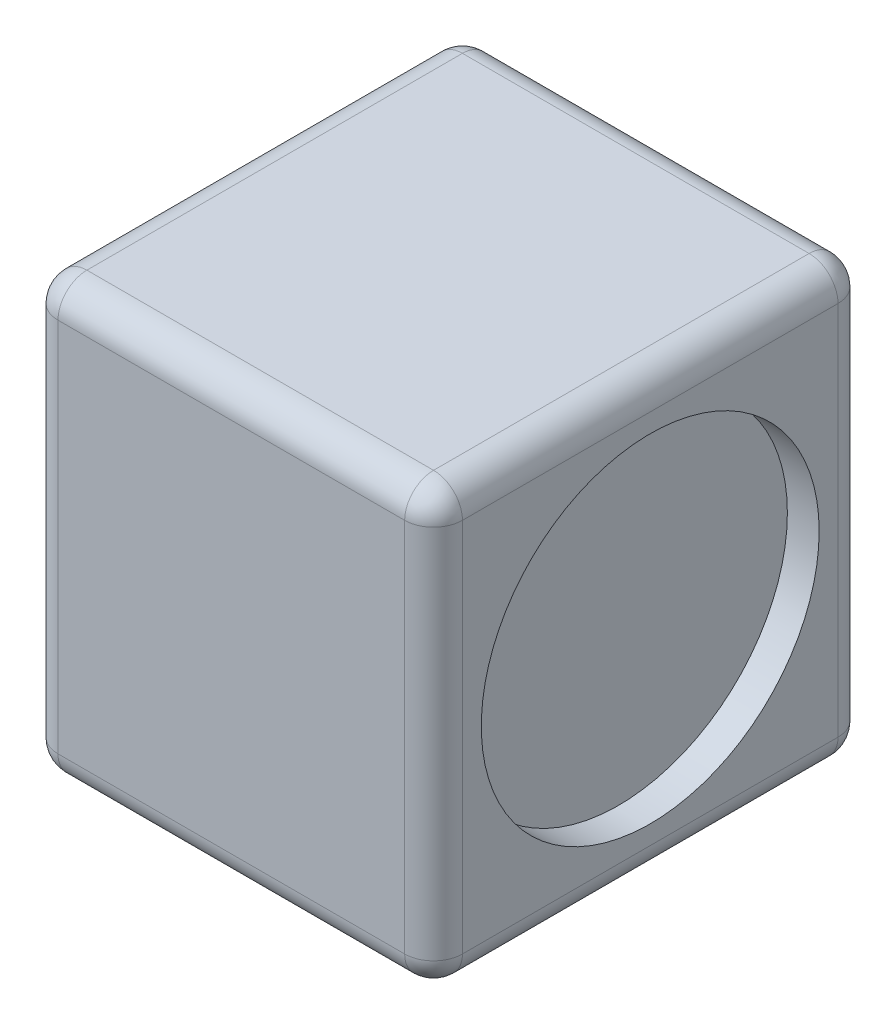
ISO-10303-21;
HEADER;
FILE_DESCRIPTION(('STEP AP214'),'2;1');
FILE_NAME('part.step','',(''),(''),'','','');
FILE_SCHEMA(('AUTOMOTIVE_DESIGN { 1 0 10303 214 1 1 1 1 }'));
ENDSEC;
DATA;
#1=APPLICATION_CONTEXT('core data for automotive mechanical design processes');
#2=APPLICATION_PROTOCOL_DEFINITION('international standard','automotive_design',2000,#1);
#3=PRODUCT_CONTEXT('',#1,'mechanical');
#4=PRODUCT('Part','Part','',(#3));
#5=PRODUCT_RELATED_PRODUCT_CATEGORY('part','',(#4));
#6=PRODUCT_DEFINITION_FORMATION('','',#4);
#7=PRODUCT_DEFINITION_CONTEXT('part definition',#1,'design');
#8=PRODUCT_DEFINITION('design','',#6,#7);
#9=PRODUCT_DEFINITION_SHAPE('','',#8);
#10=(LENGTH_UNIT() NAMED_UNIT(*) SI_UNIT(.MILLI.,.METRE.));
#11=(NAMED_UNIT(*) PLANE_ANGLE_UNIT() SI_UNIT($,.RADIAN.));
#12=(NAMED_UNIT(*) SI_UNIT($,.STERADIAN.) SOLID_ANGLE_UNIT());
#13=UNCERTAINTY_MEASURE_WITH_UNIT(LENGTH_MEASURE(1.E-05),#10,'distance_accuracy_value','');
#14=(GEOMETRIC_REPRESENTATION_CONTEXT(3) GLOBAL_UNCERTAINTY_ASSIGNED_CONTEXT((#13)) GLOBAL_UNIT_ASSIGNED_CONTEXT((#10,
#11,#12)) REPRESENTATION_CONTEXT('',''));
#15=CARTESIAN_POINT('',(0.,0.,0.));
#16=DIRECTION('',(0.,0.,1.));
#17=DIRECTION('',(1.,0.,0.));
#18=AXIS2_PLACEMENT_3D('',#15,#16,#17);
#19=CARTESIAN_POINT('',(0.,0.,0.));
#20=DIRECTION('',(0.,1.,0.));
#21=DIRECTION('',(0.,0.,1.));
#22=AXIS2_PLACEMENT_3D('',#19,#20,#21);
#23=PLANE('',#22);
#24=DIRECTION('',(0.,0.,1.));
#25=VECTOR('',#24,1.);
#26=CARTESIAN_POINT('',(-15.24,0.,0.));
#27=LINE('',#26,#25);
#28=CARTESIAN_POINT('',(-15.24,0.,16.51));
#29=VERTEX_POINT('',#28);
#30=CARTESIAN_POINT('',(-15.24,0.,-16.51));
#31=VERTEX_POINT('',#30);
#32=EDGE_CURVE('E54',#29,#31,#27,.F.);
#33=ORIENTED_EDGE('',*,*,#32,.T.);
#34=DIRECTION('',(-1.,0.,0.));
#35=VECTOR('',#34,1.);
#36=CARTESIAN_POINT('',(0.,0.,-16.51));
#37=LINE('',#36,#35);
#38=CARTESIAN_POINT('',(15.24,0.,-16.51));
#39=VERTEX_POINT('',#38);
#40=EDGE_CURVE('E11',#31,#39,#37,.F.);
#41=ORIENTED_EDGE('',*,*,#40,.T.);
#42=DIRECTION('',(0.,0.,-1.));
#43=VECTOR('',#42,1.);
#44=CARTESIAN_POINT('',(15.24,0.,0.));
#45=LINE('',#44,#43);
#46=CARTESIAN_POINT('',(15.24,0.,16.51));
#47=VERTEX_POINT('',#46);
#48=EDGE_CURVE('E249',#39,#47,#45,.F.);
#49=ORIENTED_EDGE('',*,*,#48,.T.);
#50=DIRECTION('',(1.,0.,0.));
#51=VECTOR('',#50,1.);
#52=CARTESIAN_POINT('',(0.,0.,16.51));
#53=LINE('',#52,#51);
#54=EDGE_CURVE('E251',#47,#29,#53,.F.);
#55=ORIENTED_EDGE('',*,*,#54,.T.);
#56=EDGE_LOOP('',(#33,#41,#49,#55));
#57=FACE_BOUND('',#56,.T.);
#58=DIRECTION('',(1.,0.,0.));
#59=VECTOR('',#58,1.);
#60=CARTESIAN_POINT('',(-8.89,0.,-6.35));
#61=LINE('',#60,#59);
#62=CARTESIAN_POINT('',(-8.89,0.,-6.35));
#63=VERTEX_POINT('',#62);
#64=CARTESIAN_POINT('',(-2.54,0.,-6.35));
#65=VERTEX_POINT('',#64);
#66=EDGE_CURVE('E176',#63,#65,#61,.T.);
#67=ORIENTED_EDGE('',*,*,#66,.F.);
#68=DIRECTION('',(0.,0.,-1.));
#69=VECTOR('',#68,1.);
#70=CARTESIAN_POINT('',(-8.89,0.,6.35));
#71=LINE('',#70,#69);
#72=CARTESIAN_POINT('',(-8.89,0.,6.35));
#73=VERTEX_POINT('',#72);
#74=EDGE_CURVE('E171',#73,#63,#71,.T.);
#75=ORIENTED_EDGE('',*,*,#74,.F.);
#76=DIRECTION('',(1.,0.,0.));
#77=VECTOR('',#76,1.);
#78=CARTESIAN_POINT('',(-8.89,0.,6.35));
#79=LINE('',#78,#77);
#80=CARTESIAN_POINT('',(-2.54,0.,6.35));
#81=VERTEX_POINT('',#80);
#82=EDGE_CURVE('E67',#73,#81,#79,.T.);
#83=ORIENTED_EDGE('',*,*,#82,.T.);
#84=DIRECTION('',(0.,0.,-1.));
#85=VECTOR('',#84,1.);
#86=CARTESIAN_POINT('',(-2.54,0.,6.35));
#87=LINE('',#86,#85);
#88=EDGE_CURVE('E62',#81,#65,#87,.T.);
#89=ORIENTED_EDGE('',*,*,#88,.T.);
#90=EDGE_LOOP('',(#67,#75,#83,#89));
#91=FACE_BOUND('',#90,.T.);
#92=ADVANCED_FACE('F45',(#57,#91),#23,.F.);
#93=CARTESIAN_POINT('',(17.78,38.1,-19.05));
#94=DIRECTION('',(-1.,0.,0.));
#95=DIRECTION('',(0.,0.,1.));
#96=AXIS2_PLACEMENT_3D('',#93,#94,#95);
#97=PLANE('',#96);
#98=CARTESIAN_POINT('',(17.78,19.05,0.));
#99=DIRECTION('',(1.,0.,0.));
#100=DIRECTION('',(0.,0.,-1.));
#101=AXIS2_PLACEMENT_3D('',#98,#99,#100);
#102=CIRCLE('',#101,14.8536099371406);
#103=CARTESIAN_POINT('',(17.78,19.05,-14.8536099371406));
#104=VERTEX_POINT('',#103);
#105=EDGE_CURVE('E178',#104,#104,#102,.T.);
#106=ORIENTED_EDGE('',*,*,#105,.F.);
#107=EDGE_LOOP('',(#106));
#108=FACE_BOUND('',#107,.T.);
#109=DIRECTION('',(0.,-1.,0.));
#110=VECTOR('',#109,1.);
#111=CARTESIAN_POINT('',(17.78,38.1,-16.51));
#112=LINE('',#111,#110);
#113=CARTESIAN_POINT('',(17.78,2.54,-16.51));
#114=VERTEX_POINT('',#113);
#115=CARTESIAN_POINT('',(17.78,35.56,-16.51));
#116=VERTEX_POINT('',#115);
#117=EDGE_CURVE('E217',#114,#116,#112,.F.);
#118=ORIENTED_EDGE('',*,*,#117,.T.);
#119=DIRECTION('',(0.,0.,-1.));
#120=VECTOR('',#119,1.);
#121=CARTESIAN_POINT('',(17.78,35.56,19.05));
#122=LINE('',#121,#120);
#123=CARTESIAN_POINT('',(17.78,35.56,16.51));
#124=VERTEX_POINT('',#123);
#125=EDGE_CURVE('E220',#116,#124,#122,.F.);
#126=ORIENTED_EDGE('',*,*,#125,.T.);
#127=DIRECTION('',(0.,-1.,0.));
#128=VECTOR('',#127,1.);
#129=CARTESIAN_POINT('',(17.78,38.1,16.51));
#130=LINE('',#129,#128);
#131=CARTESIAN_POINT('',(17.78,2.54,16.51));
#132=VERTEX_POINT('',#131);
#133=EDGE_CURVE('E215',#124,#132,#130,.T.);
#134=ORIENTED_EDGE('',*,*,#133,.T.);
#135=DIRECTION('',(0.,0.,-1.));
#136=VECTOR('',#135,1.);
#137=CARTESIAN_POINT('',(17.78,2.54,-19.05));
#138=LINE('',#137,#136);
#139=EDGE_CURVE('E213',#132,#114,#138,.T.);
#140=ORIENTED_EDGE('',*,*,#139,.T.);
#141=EDGE_LOOP('',(#118,#126,#134,#140));
#142=FACE_BOUND('',#141,.T.);
#143=ADVANCED_FACE('F380',(#108,#142),#97,.F.);
#144=CARTESIAN_POINT('',(-17.78,38.1,-19.05));
#145=DIRECTION('',(0.,0.,1.));
#146=DIRECTION('',(1.,0.,0.));
#147=AXIS2_PLACEMENT_3D('',#144,#145,#146);
#148=PLANE('',#147);
#149=DIRECTION('',(0.,-1.,0.));
#150=VECTOR('',#149,1.);
#151=CARTESIAN_POINT('',(-15.24,38.1,-19.05));
#152=LINE('',#151,#150);
#153=CARTESIAN_POINT('',(-15.24,2.54,-19.05));
#154=VERTEX_POINT('',#153);
#155=CARTESIAN_POINT('',(-15.24,35.56,-19.05));
#156=VERTEX_POINT('',#155);
#157=EDGE_CURVE('E206',#154,#156,#152,.F.);
#158=ORIENTED_EDGE('',*,*,#157,.T.);
#159=DIRECTION('',(-1.,0.,0.));
#160=VECTOR('',#159,1.);
#161=CARTESIAN_POINT('',(17.78,35.56,-19.05));
#162=LINE('',#161,#160);
#163=CARTESIAN_POINT('',(15.24,35.56,-19.05));
#164=VERTEX_POINT('',#163);
#165=EDGE_CURVE('E211',#156,#164,#162,.F.);
#166=ORIENTED_EDGE('',*,*,#165,.T.);
#167=DIRECTION('',(0.,-1.,0.));
#168=VECTOR('',#167,1.);
#169=CARTESIAN_POINT('',(15.24,38.1,-19.05));
#170=LINE('',#169,#168);
#171=CARTESIAN_POINT('',(15.24,2.54,-19.05));
#172=VERTEX_POINT('',#171);
#173=EDGE_CURVE('E208',#164,#172,#170,.T.);
#174=ORIENTED_EDGE('',*,*,#173,.T.);
#175=DIRECTION('',(-1.,0.,0.));
#176=VECTOR('',#175,1.);
#177=CARTESIAN_POINT('',(-17.78,2.54,-19.05));
#178=LINE('',#177,#176);
#179=EDGE_CURVE('E204',#172,#154,#178,.T.);
#180=ORIENTED_EDGE('',*,*,#179,.T.);
#181=EDGE_LOOP('',(#158,#166,#174,#180));
#182=FACE_BOUND('',#181,.T.);
#183=ADVANCED_FACE('F415',(#182),#148,.F.);
#184=CARTESIAN_POINT('',(-17.78,38.1,-19.05));
#185=DIRECTION('',(1.,0.,0.));
#186=DIRECTION('',(0.,0.,-1.));
#187=AXIS2_PLACEMENT_3D('',#184,#185,#186);
#188=PLANE('',#187);
#189=DIRECTION('',(0.,-1.,0.));
#190=VECTOR('',#189,1.);
#191=CARTESIAN_POINT('',(-17.78,38.1,16.51));
#192=LINE('',#191,#190);
#193=CARTESIAN_POINT('',(-17.78,2.54,16.51));
#194=VERTEX_POINT('',#193);
#195=CARTESIAN_POINT('',(-17.78,35.56,16.51));
#196=VERTEX_POINT('',#195);
#197=EDGE_CURVE('E224',#194,#196,#192,.F.);
#198=ORIENTED_EDGE('',*,*,#197,.T.);
#199=DIRECTION('',(0.,0.,1.));
#200=VECTOR('',#199,1.);
#201=CARTESIAN_POINT('',(-17.78,35.56,-19.05));
#202=LINE('',#201,#200);
#203=CARTESIAN_POINT('',(-17.78,35.56,-16.51));
#204=VERTEX_POINT('',#203);
#205=EDGE_CURVE('E229',#196,#204,#202,.F.);
#206=ORIENTED_EDGE('',*,*,#205,.T.);
#207=DIRECTION('',(0.,-1.,0.));
#208=VECTOR('',#207,1.);
#209=CARTESIAN_POINT('',(-17.78,38.1,-16.51));
#210=LINE('',#209,#208);
#211=CARTESIAN_POINT('',(-17.78,2.54,-16.51));
#212=VERTEX_POINT('',#211);
#213=EDGE_CURVE('E226',#204,#212,#210,.T.);
#214=ORIENTED_EDGE('',*,*,#213,.T.);
#215=DIRECTION('',(0.,0.,1.));
#216=VECTOR('',#215,1.);
#217=CARTESIAN_POINT('',(-17.78,2.54,-19.05));
#218=LINE('',#217,#216);
#219=EDGE_CURVE('E222',#212,#194,#218,.T.);
#220=ORIENTED_EDGE('',*,*,#219,.T.);
#221=EDGE_LOOP('',(#198,#206,#214,#220));
#222=FACE_BOUND('',#221,.T.);
#223=ADVANCED_FACE('F345',(#222),#188,.F.);
#224=CARTESIAN_POINT('',(-17.78,38.1,19.05));
#225=DIRECTION('',(0.,0.,-1.));
#226=DIRECTION('',(-1.,0.,0.));
#227=AXIS2_PLACEMENT_3D('',#224,#225,#226);
#228=PLANE('',#227);
#229=DIRECTION('',(0.,-1.,0.));
#230=VECTOR('',#229,1.);
#231=CARTESIAN_POINT('',(15.24,38.1,19.05));
#232=LINE('',#231,#230);
#233=CARTESIAN_POINT('',(15.24,2.54,19.05));
#234=VERTEX_POINT('',#233);
#235=CARTESIAN_POINT('',(15.24,35.56,19.05));
#236=VERTEX_POINT('',#235);
#237=EDGE_CURVE('E233',#234,#236,#232,.F.);
#238=ORIENTED_EDGE('',*,*,#237,.T.);
#239=DIRECTION('',(1.,0.,0.));
#240=VECTOR('',#239,1.);
#241=CARTESIAN_POINT('',(-17.78,35.56,19.05));
#242=LINE('',#241,#240);
#243=CARTESIAN_POINT('',(-15.24,35.56,19.05));
#244=VERTEX_POINT('',#243);
#245=EDGE_CURVE('E238',#236,#244,#242,.F.);
#246=ORIENTED_EDGE('',*,*,#245,.T.);
#247=DIRECTION('',(0.,-1.,0.));
#248=VECTOR('',#247,1.);
#249=CARTESIAN_POINT('',(-15.24,38.1,19.05));
#250=LINE('',#249,#248);
#251=CARTESIAN_POINT('',(-15.24,2.54,19.05));
#252=VERTEX_POINT('',#251);
#253=EDGE_CURVE('E235',#244,#252,#250,.T.);
#254=ORIENTED_EDGE('',*,*,#253,.T.);
#255=DIRECTION('',(1.,0.,0.));
#256=VECTOR('',#255,1.);
#257=CARTESIAN_POINT('',(-17.78,2.54,19.05));
#258=LINE('',#257,#256);
#259=EDGE_CURVE('E231',#252,#234,#258,.T.);
#260=ORIENTED_EDGE('',*,*,#259,.T.);
#261=EDGE_LOOP('',(#238,#246,#254,#260));
#262=FACE_BOUND('',#261,.T.);
#263=ADVANCED_FACE('F360',(#262),#228,.F.);
#264=CARTESIAN_POINT('',(0.,38.1,0.));
#265=DIRECTION('',(0.,1.,0.));
#266=DIRECTION('',(0.,0.,1.));
#267=AXIS2_PLACEMENT_3D('',#264,#265,#266);
#268=PLANE('',#267);
#269=DIRECTION('',(0.,0.,1.));
#270=VECTOR('',#269,1.);
#271=CARTESIAN_POINT('',(-15.24,38.1,19.05));
#272=LINE('',#271,#270);
#273=CARTESIAN_POINT('',(-15.24,38.1,-16.51));
#274=VERTEX_POINT('',#273);
#275=CARTESIAN_POINT('',(-15.24,38.1,16.51));
#276=VERTEX_POINT('',#275);
#277=EDGE_CURVE('E244',#274,#276,#272,.T.);
#278=ORIENTED_EDGE('',*,*,#277,.T.);
#279=DIRECTION('',(1.,0.,0.));
#280=VECTOR('',#279,1.);
#281=CARTESIAN_POINT('',(17.78,38.1,16.51));
#282=LINE('',#281,#280);
#283=CARTESIAN_POINT('',(15.24,38.1,16.51));
#284=VERTEX_POINT('',#283);
#285=EDGE_CURVE('E246',#276,#284,#282,.T.);
#286=ORIENTED_EDGE('',*,*,#285,.T.);
#287=DIRECTION('',(0.,0.,-1.));
#288=VECTOR('',#287,1.);
#289=CARTESIAN_POINT('',(15.24,38.1,-19.05));
#290=LINE('',#289,#288);
#291=CARTESIAN_POINT('',(15.24,38.1,-16.51));
#292=VERTEX_POINT('',#291);
#293=EDGE_CURVE('E240',#284,#292,#290,.T.);
#294=ORIENTED_EDGE('',*,*,#293,.T.);
#295=DIRECTION('',(-1.,0.,0.));
#296=VECTOR('',#295,1.);
#297=CARTESIAN_POINT('',(-17.78,38.1,-16.51));
#298=LINE('',#297,#296);
#299=EDGE_CURVE('E242',#292,#274,#298,.T.);
#300=ORIENTED_EDGE('',*,*,#299,.T.);
#301=EDGE_LOOP('',(#278,#286,#294,#300));
#302=FACE_BOUND('',#301,.T.);
#303=ADVANCED_FACE('F337',(#302),#268,.T.);
#304=CARTESIAN_POINT('',(-15.24,38.1,16.51));
#305=DIRECTION('',(0.,-1.,0.));
#306=DIRECTION('',(0.,0.,-1.));
#307=AXIS2_PLACEMENT_3D('',#304,#305,#306);
#308=CYLINDRICAL_SURFACE('',#307,2.54);
#309=CARTESIAN_POINT('',(-15.24,35.56,16.51));
#310=DIRECTION('',(0.,1.,0.));
#311=DIRECTION('',(0.,0.,1.));
#312=AXIS2_PLACEMENT_3D('',#309,#310,#311);
#313=CIRCLE('',#312,2.54);
#314=EDGE_CURVE('E49',#196,#244,#313,.T.);
#315=ORIENTED_EDGE('',*,*,#314,.F.);
#316=ORIENTED_EDGE('',*,*,#197,.F.);
#317=CARTESIAN_POINT('',(-15.24,2.54,16.51));
#318=DIRECTION('',(0.,-1.,0.));
#319=DIRECTION('',(0.,0.,-1.));
#320=AXIS2_PLACEMENT_3D('',#317,#318,#319);
#321=CIRCLE('',#320,2.54);
#322=EDGE_CURVE('E314',#252,#194,#321,.T.);
#323=ORIENTED_EDGE('',*,*,#322,.F.);
#324=ORIENTED_EDGE('',*,*,#253,.F.);
#325=EDGE_LOOP('',(#315,#316,#323,#324));
#326=FACE_BOUND('',#325,.T.);
#327=ADVANCED_FACE('F47',(#326),#308,.T.);
#328=CARTESIAN_POINT('',(-15.24,35.56,16.51));
#329=DIRECTION('',(0.,0.,1.));
#330=DIRECTION('',(1.,0.,0.));
#331=AXIS2_PLACEMENT_3D('',#328,#329,#330);
#332=SPHERICAL_SURFACE('',#331,2.54);
#333=CARTESIAN_POINT('',(-15.24,35.56,16.51));
#334=DIRECTION('',(0.,0.,1.));
#335=DIRECTION('',(1.,0.,0.));
#336=AXIS2_PLACEMENT_3D('',#333,#334,#335);
#337=CIRCLE('',#336,2.54);
#338=EDGE_CURVE('E309',#196,#276,#337,.F.);
#339=ORIENTED_EDGE('',*,*,#338,.F.);
#340=ORIENTED_EDGE('',*,*,#314,.T.);
#341=CARTESIAN_POINT('',(-15.24,35.56,16.51));
#342=DIRECTION('',(-1.,0.,0.));
#343=DIRECTION('',(0.,0.,1.));
#344=AXIS2_PLACEMENT_3D('',#341,#342,#343);
#345=CIRCLE('',#344,2.54);
#346=EDGE_CURVE('E312',#276,#244,#345,.F.);
#347=ORIENTED_EDGE('',*,*,#346,.F.);
#348=EDGE_LOOP('',(#339,#340,#347));
#349=FACE_BOUND('',#348,.T.);
#350=ADVANCED_FACE('F325',(#349),#332,.T.);
#351=CARTESIAN_POINT('',(-15.24,2.54,16.51));
#352=DIRECTION('',(-1.,0.,0.));
#353=DIRECTION('',(0.,-1.,0.));
#354=AXIS2_PLACEMENT_3D('',#351,#352,#353);
#355=SPHERICAL_SURFACE('',#354,2.54);
#356=CARTESIAN_POINT('',(-15.24,2.54,16.51));
#357=DIRECTION('',(-1.,0.,0.));
#358=DIRECTION('',(0.,0.,1.));
#359=AXIS2_PLACEMENT_3D('',#356,#357,#358);
#360=CIRCLE('',#359,2.54);
#361=EDGE_CURVE('E303',#252,#29,#360,.F.);
#362=ORIENTED_EDGE('',*,*,#361,.F.);
#363=ORIENTED_EDGE('',*,*,#322,.T.);
#364=CARTESIAN_POINT('',(-15.24,2.54,16.51));
#365=DIRECTION('',(0.,0.,1.));
#366=DIRECTION('',(1.,0.,0.));
#367=AXIS2_PLACEMENT_3D('',#364,#365,#366);
#368=CIRCLE('',#367,2.54);
#369=EDGE_CURVE('E306',#29,#194,#368,.F.);
#370=ORIENTED_EDGE('',*,*,#369,.F.);
#371=EDGE_LOOP('',(#362,#363,#370));
#372=FACE_BOUND('',#371,.T.);
#373=ADVANCED_FACE('F566',(#372),#355,.T.);
#374=CARTESIAN_POINT('',(0.,35.56,16.51));
#375=DIRECTION('',(-1.,0.,0.));
#376=DIRECTION('',(0.,0.,1.));
#377=AXIS2_PLACEMENT_3D('',#374,#375,#376);
#378=CYLINDRICAL_SURFACE('',#377,2.54);
#379=ORIENTED_EDGE('',*,*,#346,.T.);
#380=ORIENTED_EDGE('',*,*,#245,.F.);
#381=CARTESIAN_POINT('',(15.24,35.56,16.51));
#382=DIRECTION('',(1.,0.,0.));
#383=DIRECTION('',(0.,0.,-1.));
#384=AXIS2_PLACEMENT_3D('',#381,#382,#383);
#385=CIRCLE('',#384,2.54);
#386=EDGE_CURVE('E297',#284,#236,#385,.T.);
#387=ORIENTED_EDGE('',*,*,#386,.F.);
#388=ORIENTED_EDGE('',*,*,#285,.F.);
#389=EDGE_LOOP('',(#379,#380,#387,#388));
#390=FACE_BOUND('',#389,.T.);
#391=ADVANCED_FACE('F333',(#390),#378,.T.);
#392=CARTESIAN_POINT('',(-15.24,35.56,0.));
#393=DIRECTION('',(0.,0.,-1.));
#394=DIRECTION('',(-1.,0.,0.));
#395=AXIS2_PLACEMENT_3D('',#392,#393,#394);
#396=CYLINDRICAL_SURFACE('',#395,2.54);
#397=ORIENTED_EDGE('',*,*,#338,.T.);
#398=ORIENTED_EDGE('',*,*,#277,.F.);
#399=CARTESIAN_POINT('',(-15.24,35.56,-16.51));
#400=DIRECTION('',(0.,0.,-1.));
#401=DIRECTION('',(-1.,0.,0.));
#402=AXIS2_PLACEMENT_3D('',#399,#400,#401);
#403=CIRCLE('',#402,2.54);
#404=EDGE_CURVE('E294',#204,#274,#403,.T.);
#405=ORIENTED_EDGE('',*,*,#404,.F.);
#406=ORIENTED_EDGE('',*,*,#205,.F.);
#407=EDGE_LOOP('',(#397,#398,#405,#406));
#408=FACE_BOUND('',#407,.T.);
#409=ADVANCED_FACE('F342',(#408),#396,.T.);
#410=CARTESIAN_POINT('',(-15.24,38.1,-16.51));
#411=DIRECTION('',(0.,-1.,0.));
#412=DIRECTION('',(0.,0.,-1.));
#413=AXIS2_PLACEMENT_3D('',#410,#411,#412);
#414=CYLINDRICAL_SURFACE('',#413,2.54);
#415=CARTESIAN_POINT('',(-15.24,2.54,-16.51));
#416=DIRECTION('',(0.,-1.,0.));
#417=DIRECTION('',(0.,0.,-1.));
#418=AXIS2_PLACEMENT_3D('',#415,#416,#417);
#419=CIRCLE('',#418,2.54);
#420=EDGE_CURVE('E288',#212,#154,#419,.T.);
#421=ORIENTED_EDGE('',*,*,#420,.F.);
#422=ORIENTED_EDGE('',*,*,#213,.F.);
#423=CARTESIAN_POINT('',(-15.24,35.56,-16.51));
#424=DIRECTION('',(0.,1.,0.));
#425=DIRECTION('',(0.,0.,1.));
#426=AXIS2_PLACEMENT_3D('',#423,#424,#425);
#427=CIRCLE('',#426,2.54);
#428=EDGE_CURVE('E291',#156,#204,#427,.T.);
#429=ORIENTED_EDGE('',*,*,#428,.F.);
#430=ORIENTED_EDGE('',*,*,#157,.F.);
#431=EDGE_LOOP('',(#421,#422,#429,#430));
#432=FACE_BOUND('',#431,.T.);
#433=ADVANCED_FACE('F349',(#432),#414,.T.);
#434=CARTESIAN_POINT('',(-15.24,2.54,-19.05));
#435=DIRECTION('',(0.,0.,1.));
#436=DIRECTION('',(1.,0.,0.));
#437=AXIS2_PLACEMENT_3D('',#434,#435,#436);
#438=CYLINDRICAL_SURFACE('',#437,2.54);
#439=ORIENTED_EDGE('',*,*,#369,.T.);
#440=ORIENTED_EDGE('',*,*,#219,.F.);
#441=CARTESIAN_POINT('',(-15.24,2.54,-16.51));
#442=DIRECTION('',(0.,0.,-1.));
#443=DIRECTION('',(-1.,0.,0.));
#444=AXIS2_PLACEMENT_3D('',#441,#442,#443);
#445=CIRCLE('',#444,2.54);
#446=EDGE_CURVE('E286',#31,#212,#445,.T.);
#447=ORIENTED_EDGE('',*,*,#446,.F.);
#448=ORIENTED_EDGE('',*,*,#32,.F.);
#449=EDGE_LOOP('',(#439,#440,#447,#448));
#450=FACE_BOUND('',#449,.T.);
#451=ADVANCED_FACE('F357',(#450),#438,.T.);
#452=CARTESIAN_POINT('',(-17.78,2.54,16.51));
#453=DIRECTION('',(1.,0.,0.));
#454=DIRECTION('',(0.,0.,-1.));
#455=AXIS2_PLACEMENT_3D('',#452,#453,#454);
#456=CYLINDRICAL_SURFACE('',#455,2.54);
#457=ORIENTED_EDGE('',*,*,#361,.T.);
#458=ORIENTED_EDGE('',*,*,#54,.F.);
#459=CARTESIAN_POINT('',(15.24,2.54,16.51));
#460=DIRECTION('',(1.,0.,0.));
#461=DIRECTION('',(0.,0.,-1.));
#462=AXIS2_PLACEMENT_3D('',#459,#460,#461);
#463=CIRCLE('',#462,2.54);
#464=EDGE_CURVE('E283',#234,#47,#463,.T.);
#465=ORIENTED_EDGE('',*,*,#464,.F.);
#466=ORIENTED_EDGE('',*,*,#259,.F.);
#467=EDGE_LOOP('',(#457,#458,#465,#466));
#468=FACE_BOUND('',#467,.T.);
#469=ADVANCED_FACE('F370',(#468),#456,.T.);
#470=CARTESIAN_POINT('',(15.24,38.1,16.51));
#471=DIRECTION('',(0.,-1.,0.));
#472=DIRECTION('',(0.,0.,-1.));
#473=AXIS2_PLACEMENT_3D('',#470,#471,#472);
#474=CYLINDRICAL_SURFACE('',#473,2.54);
#475=CARTESIAN_POINT('',(15.24,35.56,16.51));
#476=DIRECTION('',(0.,1.,0.));
#477=DIRECTION('',(0.,0.,1.));
#478=AXIS2_PLACEMENT_3D('',#475,#476,#477);
#479=CIRCLE('',#478,2.54);
#480=EDGE_CURVE('E300',#236,#124,#479,.T.);
#481=ORIENTED_EDGE('',*,*,#480,.F.);
#482=ORIENTED_EDGE('',*,*,#237,.F.);
#483=CARTESIAN_POINT('',(15.24,2.54,16.51));
#484=DIRECTION('',(0.,-1.,0.));
#485=DIRECTION('',(0.,0.,-1.));
#486=AXIS2_PLACEMENT_3D('',#483,#484,#485);
#487=CIRCLE('',#486,2.54);
#488=EDGE_CURVE('E280',#132,#234,#487,.T.);
#489=ORIENTED_EDGE('',*,*,#488,.F.);
#490=ORIENTED_EDGE('',*,*,#133,.F.);
#491=EDGE_LOOP('',(#481,#482,#489,#490));
#492=FACE_BOUND('',#491,.T.);
#493=ADVANCED_FACE('F365',(#492),#474,.T.);
#494=CARTESIAN_POINT('',(15.24,35.56,16.51));
#495=DIRECTION('',(0.,0.,1.));
#496=DIRECTION('',(1.,0.,0.));
#497=AXIS2_PLACEMENT_3D('',#494,#495,#496);
#498=SPHERICAL_SURFACE('',#497,2.54);
#499=ORIENTED_EDGE('',*,*,#386,.T.);
#500=ORIENTED_EDGE('',*,*,#480,.T.);
#501=CARTESIAN_POINT('',(15.24,35.56,16.51));
#502=DIRECTION('',(0.,0.,1.));
#503=DIRECTION('',(1.,0.,0.));
#504=AXIS2_PLACEMENT_3D('',#501,#502,#503);
#505=CIRCLE('',#504,2.54);
#506=EDGE_CURVE('E277',#284,#124,#505,.F.);
#507=ORIENTED_EDGE('',*,*,#506,.F.);
#508=EDGE_LOOP('',(#499,#500,#507));
#509=FACE_BOUND('',#508,.T.);
#510=ADVANCED_FACE('F384',(#509),#498,.T.);
#511=CARTESIAN_POINT('',(-15.24,35.56,-16.51));
#512=DIRECTION('',(-1.,0.,0.));
#513=DIRECTION('',(0.,0.,1.));
#514=AXIS2_PLACEMENT_3D('',#511,#512,#513);
#515=SPHERICAL_SURFACE('',#514,2.54);
#516=ORIENTED_EDGE('',*,*,#428,.T.);
#517=ORIENTED_EDGE('',*,*,#404,.T.);
#518=CARTESIAN_POINT('',(-15.24,35.56,-16.51));
#519=DIRECTION('',(-1.,0.,0.));
#520=DIRECTION('',(0.,0.,1.));
#521=AXIS2_PLACEMENT_3D('',#518,#519,#520);
#522=CIRCLE('',#521,2.54);
#523=EDGE_CURVE('E274',#156,#274,#522,.F.);
#524=ORIENTED_EDGE('',*,*,#523,.F.);
#525=EDGE_LOOP('',(#516,#517,#524));
#526=FACE_BOUND('',#525,.T.);
#527=ADVANCED_FACE('F397',(#526),#515,.T.);
#528=CARTESIAN_POINT('',(-15.24,2.54,-16.51));
#529=DIRECTION('',(-1.,0.,0.));
#530=DIRECTION('',(0.,-1.,0.));
#531=AXIS2_PLACEMENT_3D('',#528,#529,#530);
#532=SPHERICAL_SURFACE('',#531,2.54);
#533=ORIENTED_EDGE('',*,*,#446,.T.);
#534=ORIENTED_EDGE('',*,*,#420,.T.);
#535=CARTESIAN_POINT('',(-15.24,2.54,-16.51));
#536=DIRECTION('',(-1.,0.,0.));
#537=DIRECTION('',(0.,0.,1.));
#538=AXIS2_PLACEMENT_3D('',#535,#536,#537);
#539=CIRCLE('',#538,2.54);
#540=EDGE_CURVE('E271',#31,#154,#539,.F.);
#541=ORIENTED_EDGE('',*,*,#540,.F.);
#542=EDGE_LOOP('',(#533,#534,#541));
#543=FACE_BOUND('',#542,.T.);
#544=ADVANCED_FACE('F399',(#543),#532,.T.);
#545=CARTESIAN_POINT('',(15.24,2.54,16.51));
#546=DIRECTION('',(0.,0.,1.));
#547=DIRECTION('',(0.,-1.,0.));
#548=AXIS2_PLACEMENT_3D('',#545,#546,#547);
#549=SPHERICAL_SURFACE('',#548,2.54);
#550=ORIENTED_EDGE('',*,*,#488,.T.);
#551=ORIENTED_EDGE('',*,*,#464,.T.);
#552=CARTESIAN_POINT('',(15.24,2.54,16.51));
#553=DIRECTION('',(0.,0.,1.));
#554=DIRECTION('',(1.,0.,0.));
#555=AXIS2_PLACEMENT_3D('',#552,#553,#554);
#556=CIRCLE('',#555,2.54);
#557=EDGE_CURVE('E268',#132,#47,#556,.F.);
#558=ORIENTED_EDGE('',*,*,#557,.F.);
#559=EDGE_LOOP('',(#550,#551,#558));
#560=FACE_BOUND('',#559,.T.);
#561=ADVANCED_FACE('F372',(#560),#549,.T.);
#562=CARTESIAN_POINT('',(15.24,35.56,0.));
#563=DIRECTION('',(0.,0.,1.));
#564=DIRECTION('',(1.,0.,0.));
#565=AXIS2_PLACEMENT_3D('',#562,#563,#564);
#566=CYLINDRICAL_SURFACE('',#565,2.54);
#567=ORIENTED_EDGE('',*,*,#506,.T.);
#568=ORIENTED_EDGE('',*,*,#125,.F.);
#569=CARTESIAN_POINT('',(15.24,35.56,-16.51));
#570=DIRECTION('',(0.,0.,-1.));
#571=DIRECTION('',(-1.,0.,0.));
#572=AXIS2_PLACEMENT_3D('',#569,#570,#571);
#573=CIRCLE('',#572,2.54);
#574=EDGE_CURVE('E265',#292,#116,#573,.T.);
#575=ORIENTED_EDGE('',*,*,#574,.F.);
#576=ORIENTED_EDGE('',*,*,#293,.F.);
#577=EDGE_LOOP('',(#567,#568,#575,#576));
#578=FACE_BOUND('',#577,.T.);
#579=ADVANCED_FACE('F386',(#578),#566,.T.);
#580=CARTESIAN_POINT('',(0.,35.56,-16.51));
#581=DIRECTION('',(1.,0.,0.));
#582=DIRECTION('',(0.,0.,-1.));
#583=AXIS2_PLACEMENT_3D('',#580,#581,#582);
#584=CYLINDRICAL_SURFACE('',#583,2.54);
#585=ORIENTED_EDGE('',*,*,#523,.T.);
#586=ORIENTED_EDGE('',*,*,#299,.F.);
#587=CARTESIAN_POINT('',(15.24,35.56,-16.51));
#588=DIRECTION('',(1.,0.,0.));
#589=DIRECTION('',(0.,0.,-1.));
#590=AXIS2_PLACEMENT_3D('',#587,#588,#589);
#591=CIRCLE('',#590,2.54);
#592=EDGE_CURVE('E262',#164,#292,#591,.T.);
#593=ORIENTED_EDGE('',*,*,#592,.F.);
#594=ORIENTED_EDGE('',*,*,#165,.F.);
#595=EDGE_LOOP('',(#585,#586,#593,#594));
#596=FACE_BOUND('',#595,.T.);
#597=ADVANCED_FACE('F395',(#596),#584,.T.);
#598=CARTESIAN_POINT('',(-17.78,2.54,-16.51));
#599=DIRECTION('',(-1.,0.,0.));
#600=DIRECTION('',(0.,0.,1.));
#601=AXIS2_PLACEMENT_3D('',#598,#599,#600);
#602=CYLINDRICAL_SURFACE('',#601,2.54);
#603=ORIENTED_EDGE('',*,*,#540,.T.);
#604=ORIENTED_EDGE('',*,*,#179,.F.);
#605=CARTESIAN_POINT('',(15.24,2.54,-16.51));
#606=DIRECTION('',(1.,0.,0.));
#607=DIRECTION('',(0.,0.,-1.));
#608=AXIS2_PLACEMENT_3D('',#605,#606,#607);
#609=CIRCLE('',#608,2.54);
#610=EDGE_CURVE('E259',#39,#172,#609,.T.);
#611=ORIENTED_EDGE('',*,*,#610,.F.);
#612=ORIENTED_EDGE('',*,*,#40,.F.);
#613=EDGE_LOOP('',(#603,#604,#611,#612));
#614=FACE_BOUND('',#613,.T.);
#615=ADVANCED_FACE('F441',(#614),#602,.T.);
#616=CARTESIAN_POINT('',(15.24,2.54,-19.05));
#617=DIRECTION('',(0.,0.,-1.));
#618=DIRECTION('',(-1.,0.,0.));
#619=AXIS2_PLACEMENT_3D('',#616,#617,#618);
#620=CYLINDRICAL_SURFACE('',#619,2.54);
#621=ORIENTED_EDGE('',*,*,#557,.T.);
#622=ORIENTED_EDGE('',*,*,#48,.F.);
#623=CARTESIAN_POINT('',(15.24,2.54,-16.51));
#624=DIRECTION('',(0.,0.,-1.));
#625=DIRECTION('',(-1.,0.,0.));
#626=AXIS2_PLACEMENT_3D('',#623,#624,#625);
#627=CIRCLE('',#626,2.54);
#628=EDGE_CURVE('E257',#114,#39,#627,.T.);
#629=ORIENTED_EDGE('',*,*,#628,.F.);
#630=ORIENTED_EDGE('',*,*,#139,.F.);
#631=EDGE_LOOP('',(#621,#622,#629,#630));
#632=FACE_BOUND('',#631,.T.);
#633=ADVANCED_FACE('F377',(#632),#620,.T.);
#634=CARTESIAN_POINT('',(15.24,35.56,-16.51));
#635=DIRECTION('',(0.,1.,0.));
#636=DIRECTION('',(0.,0.,1.));
#637=AXIS2_PLACEMENT_3D('',#634,#635,#636);
#638=SPHERICAL_SURFACE('',#637,2.54);
#639=ORIENTED_EDGE('',*,*,#592,.T.);
#640=ORIENTED_EDGE('',*,*,#574,.T.);
#641=CARTESIAN_POINT('',(15.24,35.56,-16.51));
#642=DIRECTION('',(0.,1.,0.));
#643=DIRECTION('',(0.,0.,1.));
#644=AXIS2_PLACEMENT_3D('',#641,#642,#643);
#645=CIRCLE('',#644,2.54);
#646=EDGE_CURVE('E255',#164,#116,#645,.F.);
#647=ORIENTED_EDGE('',*,*,#646,.F.);
#648=EDGE_LOOP('',(#639,#640,#647));
#649=FACE_BOUND('',#648,.T.);
#650=ADVANCED_FACE('F391',(#649),#638,.T.);
#651=CARTESIAN_POINT('',(15.24,2.54,-16.51));
#652=DIRECTION('',(0.,-1.,0.));
#653=DIRECTION('',(0.,0.,-1.));
#654=AXIS2_PLACEMENT_3D('',#651,#652,#653);
#655=SPHERICAL_SURFACE('',#654,2.54);
#656=ORIENTED_EDGE('',*,*,#628,.T.);
#657=ORIENTED_EDGE('',*,*,#610,.T.);
#658=CARTESIAN_POINT('',(15.24,2.54,-16.51));
#659=DIRECTION('',(0.,-1.,0.));
#660=DIRECTION('',(0.,0.,-1.));
#661=AXIS2_PLACEMENT_3D('',#658,#659,#660);
#662=CIRCLE('',#661,2.54);
#663=EDGE_CURVE('E201',#114,#172,#662,.F.);
#664=ORIENTED_EDGE('',*,*,#663,.F.);
#665=EDGE_LOOP('',(#656,#657,#664));
#666=FACE_BOUND('',#665,.T.);
#667=ADVANCED_FACE('F432',(#666),#655,.T.);
#668=CARTESIAN_POINT('',(15.24,38.1,-16.51));
#669=DIRECTION('',(0.,-1.,0.));
#670=DIRECTION('',(0.,0.,-1.));
#671=AXIS2_PLACEMENT_3D('',#668,#669,#670);
#672=CYLINDRICAL_SURFACE('',#671,2.54);
#673=ORIENTED_EDGE('',*,*,#646,.T.);
#674=ORIENTED_EDGE('',*,*,#117,.F.);
#675=ORIENTED_EDGE('',*,*,#663,.T.);
#676=ORIENTED_EDGE('',*,*,#173,.F.);
#677=EDGE_LOOP('',(#673,#674,#675,#676));
#678=FACE_BOUND('',#677,.T.);
#679=ADVANCED_FACE('F428',(#678),#672,.T.);
#680=CARTESIAN_POINT('',(14.986,19.05,0.));
#681=DIRECTION('',(1.,0.,0.));
#682=DIRECTION('',(0.,0.,-1.));
#683=AXIS2_PLACEMENT_3D('',#680,#681,#682);
#684=CYLINDRICAL_SURFACE('',#683,14.8536099371406);
#685=CARTESIAN_POINT('',(14.986,19.05,0.));
#686=DIRECTION('',(1.,0.,0.));
#687=DIRECTION('',(0.,0.,-1.));
#688=AXIS2_PLACEMENT_3D('',#685,#686,#687);
#689=CIRCLE('',#688,14.8536099371406);
#690=CARTESIAN_POINT('',(14.986,19.05,-14.8536099371406));
#691=VERTEX_POINT('',#690);
#692=EDGE_CURVE('E198',#691,#691,#689,.T.);
#693=ORIENTED_EDGE('',*,*,#692,.F.);
#694=EDGE_LOOP('',(#693));
#695=FACE_BOUND('',#694,.T.);
#696=ORIENTED_EDGE('',*,*,#105,.T.);
#697=EDGE_LOOP('',(#696));
#698=FACE_BOUND('',#697,.T.);
#699=ADVANCED_FACE('F431',(#695,#698),#684,.F.);
#700=CARTESIAN_POINT('',(14.986,19.05,0.));
#701=DIRECTION('',(1.,0.,0.));
#702=DIRECTION('',(0.,0.,-1.));
#703=AXIS2_PLACEMENT_3D('',#700,#701,#702);
#704=PLANE('',#703);
#705=ORIENTED_EDGE('',*,*,#692,.T.);
#706=EDGE_LOOP('',(#705));
#707=FACE_BOUND('',#706,.T.);
#708=ADVANCED_FACE('F492',(#707),#704,.T.);
#709=CARTESIAN_POINT('',(-8.89,-1.27,-6.35));
#710=DIRECTION('',(0.,0.,1.));
#711=DIRECTION('',(1.,0.,0.));
#712=AXIS2_PLACEMENT_3D('',#709,#710,#711);
#713=PLANE('',#712);
#714=ORIENTED_EDGE('',*,*,#66,.T.);
#715=DIRECTION('',(0.,1.,0.));
#716=VECTOR('',#715,1.);
#717=CARTESIAN_POINT('',(-2.54,-1.27,-6.35));
#718=LINE('',#717,#716);
#719=CARTESIAN_POINT('',(-2.54,-1.27,-6.35));
#720=VERTEX_POINT('',#719);
#721=EDGE_CURVE('E174',#720,#65,#718,.T.);
#722=ORIENTED_EDGE('',*,*,#721,.F.);
#723=DIRECTION('',(1.,0.,0.));
#724=VECTOR('',#723,1.);
#725=CARTESIAN_POINT('',(-8.89,-1.27,-6.35));
#726=LINE('',#725,#724);
#727=CARTESIAN_POINT('',(-8.89,-1.27,-6.35));
#728=VERTEX_POINT('',#727);
#729=EDGE_CURVE('E159',#728,#720,#726,.T.);
#730=ORIENTED_EDGE('',*,*,#729,.F.);
#731=DIRECTION('',(0.,1.,0.));
#732=VECTOR('',#731,1.);
#733=CARTESIAN_POINT('',(-8.89,-1.27,-6.35));
#734=LINE('',#733,#732);
#735=EDGE_CURVE('E187',#728,#63,#734,.T.);
#736=ORIENTED_EDGE('',*,*,#735,.T.);
#737=EDGE_LOOP('',(#714,#722,#730,#736));
#738=FACE_BOUND('',#737,.T.);
#739=ADVANCED_FACE('F175',(#738),#713,.F.);
#740=CARTESIAN_POINT('',(-2.54,-1.27,6.35));
#741=DIRECTION('',(1.,0.,0.));
#742=DIRECTION('',(0.,0.,-1.));
#743=AXIS2_PLACEMENT_3D('',#740,#741,#742);
#744=PLANE('',#743);
#745=ORIENTED_EDGE('',*,*,#88,.F.);
#746=DIRECTION('',(0.,1.,0.));
#747=VECTOR('',#746,1.);
#748=CARTESIAN_POINT('',(-2.54,-1.27,6.35));
#749=LINE('',#748,#747);
#750=CARTESIAN_POINT('',(-2.54,-1.27,6.35));
#751=VERTEX_POINT('',#750);
#752=EDGE_CURVE('E179',#751,#81,#749,.T.);
#753=ORIENTED_EDGE('',*,*,#752,.F.);
#754=DIRECTION('',(0.,0.,-1.));
#755=VECTOR('',#754,1.);
#756=CARTESIAN_POINT('',(-2.54,-1.27,6.35));
#757=LINE('',#756,#755);
#758=EDGE_CURVE('E164',#751,#720,#757,.T.);
#759=ORIENTED_EDGE('',*,*,#758,.T.);
#760=ORIENTED_EDGE('',*,*,#721,.T.);
#761=EDGE_LOOP('',(#745,#753,#759,#760));
#762=FACE_BOUND('',#761,.T.);
#763=ADVANCED_FACE('F181',(#762),#744,.T.);
#764=CARTESIAN_POINT('',(-8.89,-1.27,6.35));
#765=DIRECTION('',(0.,0.,1.));
#766=DIRECTION('',(1.,0.,0.));
#767=AXIS2_PLACEMENT_3D('',#764,#765,#766);
#768=PLANE('',#767);
#769=ORIENTED_EDGE('',*,*,#82,.F.);
#770=DIRECTION('',(0.,1.,0.));
#771=VECTOR('',#770,1.);
#772=CARTESIAN_POINT('',(-8.89,-1.27,6.35));
#773=LINE('',#772,#771);
#774=CARTESIAN_POINT('',(-8.89,-1.27,6.35));
#775=VERTEX_POINT('',#774);
#776=EDGE_CURVE('E194',#775,#73,#773,.T.);
#777=ORIENTED_EDGE('',*,*,#776,.F.);
#778=DIRECTION('',(1.,0.,0.));
#779=VECTOR('',#778,1.);
#780=CARTESIAN_POINT('',(-8.89,-1.27,6.35));
#781=LINE('',#780,#779);
#782=EDGE_CURVE('E182',#775,#751,#781,.T.);
#783=ORIENTED_EDGE('',*,*,#782,.T.);
#784=ORIENTED_EDGE('',*,*,#752,.T.);
#785=EDGE_LOOP('',(#769,#777,#783,#784));
#786=FACE_BOUND('',#785,.T.);
#787=ADVANCED_FACE('F514',(#786),#768,.T.);
#788=CARTESIAN_POINT('',(-8.89,-1.27,6.35));
#789=DIRECTION('',(1.,0.,0.));
#790=DIRECTION('',(0.,0.,-1.));
#791=AXIS2_PLACEMENT_3D('',#788,#789,#790);
#792=PLANE('',#791);
#793=ORIENTED_EDGE('',*,*,#74,.T.);
#794=ORIENTED_EDGE('',*,*,#735,.F.);
#795=DIRECTION('',(0.,0.,-1.));
#796=VECTOR('',#795,1.);
#797=CARTESIAN_POINT('',(-8.89,-1.27,6.35));
#798=LINE('',#797,#796);
#799=EDGE_CURVE('E167',#775,#728,#798,.T.);
#800=ORIENTED_EDGE('',*,*,#799,.F.);
#801=ORIENTED_EDGE('',*,*,#776,.T.);
#802=EDGE_LOOP('',(#793,#794,#800,#801));
#803=FACE_BOUND('',#802,.T.);
#804=ADVANCED_FACE('F521',(#803),#792,.F.);
#805=CARTESIAN_POINT('',(0.,-1.27,0.));
#806=DIRECTION('',(0.,1.,0.));
#807=DIRECTION('',(0.,0.,1.));
#808=AXIS2_PLACEMENT_3D('',#805,#806,#807);
#809=PLANE('',#808);
#810=ORIENTED_EDGE('',*,*,#729,.T.);
#811=ORIENTED_EDGE('',*,*,#758,.F.);
#812=ORIENTED_EDGE('',*,*,#782,.F.);
#813=ORIENTED_EDGE('',*,*,#799,.T.);
#814=EDGE_LOOP('',(#810,#811,#812,#813));
#815=FACE_BOUND('',#814,.T.);
#816=ADVANCED_FACE('F161',(#815),#809,.F.);
#817=CLOSED_SHELL('',(#92,#143,#183,#223,#263,#303,#327,#350,#373,#391,#409,#433,#451,#469,#493,
#510,#527,#544,#561,#579,#597,#615,#633,#650,#667,#679,#699,#708,#739,#763,#787,#804,#816));
#818=MANIFOLD_SOLID_BREP('B2',#817);
#819=ADVANCED_BREP_SHAPE_REPRESENTATION('',(#18,#818),#14);
#820=SHAPE_DEFINITION_REPRESENTATION(#9,#819);
ENDSEC;
END-ISO-10303-21;
